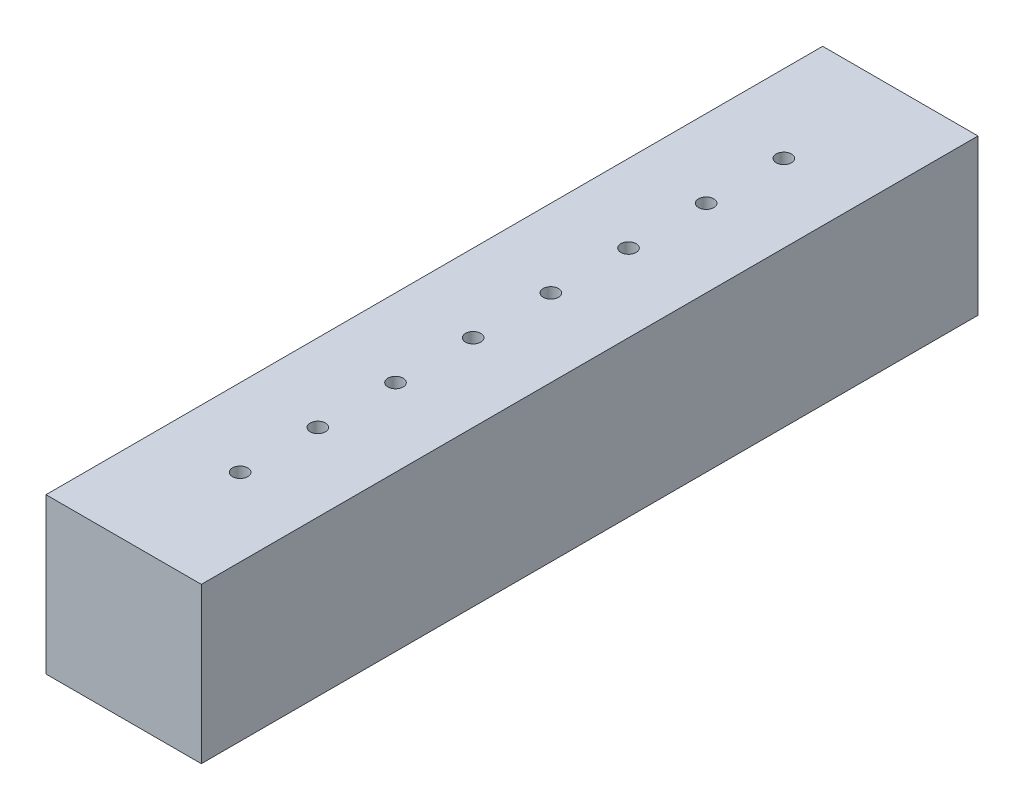
ISO-10303-21;
HEADER;
FILE_DESCRIPTION(('STEP AP214'),'2;1');
FILE_NAME('part.step','',(''),(''),'','','');
FILE_SCHEMA(('AUTOMOTIVE_DESIGN { 1 0 10303 214 1 1 1 1 }'));
ENDSEC;
DATA;
#1=APPLICATION_CONTEXT('core data for automotive mechanical design processes');
#2=APPLICATION_PROTOCOL_DEFINITION('international standard','automotive_design',2000,#1);
#3=PRODUCT_CONTEXT('',#1,'mechanical');
#4=PRODUCT('Part','Part','',(#3));
#5=PRODUCT_RELATED_PRODUCT_CATEGORY('part','',(#4));
#6=PRODUCT_DEFINITION_FORMATION('','',#4);
#7=PRODUCT_DEFINITION_CONTEXT('part definition',#1,'design');
#8=PRODUCT_DEFINITION('design','',#6,#7);
#9=PRODUCT_DEFINITION_SHAPE('','',#8);
#10=(LENGTH_UNIT() NAMED_UNIT(*) SI_UNIT(.MILLI.,.METRE.));
#11=(NAMED_UNIT(*) PLANE_ANGLE_UNIT() SI_UNIT($,.RADIAN.));
#12=(NAMED_UNIT(*) SI_UNIT($,.STERADIAN.) SOLID_ANGLE_UNIT());
#13=UNCERTAINTY_MEASURE_WITH_UNIT(LENGTH_MEASURE(1.E-05),#10,'distance_accuracy_value','');
#14=(GEOMETRIC_REPRESENTATION_CONTEXT(3) GLOBAL_UNCERTAINTY_ASSIGNED_CONTEXT((#13)) GLOBAL_UNIT_ASSIGNED_CONTEXT((#10,
#11,#12)) REPRESENTATION_CONTEXT('',''));
#15=CARTESIAN_POINT('',(0.,0.,0.));
#16=DIRECTION('',(0.,0.,1.));
#17=DIRECTION('',(1.,0.,0.));
#18=AXIS2_PLACEMENT_3D('',#15,#16,#17);
#19=CARTESIAN_POINT('',(-25.4,50.8,127.));
#20=DIRECTION('',(1.,0.,0.));
#21=DIRECTION('',(0.,0.,-1.));
#22=AXIS2_PLACEMENT_3D('',#19,#20,#21);
#23=PLANE('',#22);
#24=DIRECTION('',(0.,0.,1.));
#25=VECTOR('',#24,1.);
#26=CARTESIAN_POINT('',(-25.4,0.,127.));
#27=LINE('',#26,#25);
#28=CARTESIAN_POINT('',(-25.4,0.,-127.));
#29=VERTEX_POINT('',#28);
#30=CARTESIAN_POINT('',(-25.4,0.,127.));
#31=VERTEX_POINT('',#30);
#32=EDGE_CURVE('E96',#29,#31,#27,.T.);
#33=ORIENTED_EDGE('',*,*,#32,.T.);
#34=DIRECTION('',(0.,-1.,0.));
#35=VECTOR('',#34,1.);
#36=CARTESIAN_POINT('',(-25.4,50.8,127.));
#37=LINE('',#36,#35);
#38=CARTESIAN_POINT('',(-25.4,50.8,127.));
#39=VERTEX_POINT('',#38);
#40=EDGE_CURVE('E11',#39,#31,#37,.T.);
#41=ORIENTED_EDGE('',*,*,#40,.F.);
#42=DIRECTION('',(0.,0.,1.));
#43=VECTOR('',#42,1.);
#44=CARTESIAN_POINT('',(-25.4,50.8,127.));
#45=LINE('',#44,#43);
#46=CARTESIAN_POINT('',(-25.4,50.8,-127.));
#47=VERTEX_POINT('',#46);
#48=EDGE_CURVE('E84',#47,#39,#45,.T.);
#49=ORIENTED_EDGE('',*,*,#48,.F.);
#50=DIRECTION('',(0.,-1.,0.));
#51=VECTOR('',#50,1.);
#52=CARTESIAN_POINT('',(-25.4,50.8,-127.));
#53=LINE('',#52,#51);
#54=EDGE_CURVE('E92',#47,#29,#53,.T.);
#55=ORIENTED_EDGE('',*,*,#54,.T.);
#56=EDGE_LOOP('',(#33,#41,#49,#55));
#57=FACE_BOUND('',#56,.T.);
#58=ADVANCED_FACE('F33',(#57),#23,.F.);
#59=CARTESIAN_POINT('',(25.4,50.8,127.));
#60=DIRECTION('',(0.,0.,-1.));
#61=DIRECTION('',(-1.,0.,0.));
#62=AXIS2_PLACEMENT_3D('',#59,#60,#61);
#63=PLANE('',#62);
#64=DIRECTION('',(1.,0.,0.));
#65=VECTOR('',#64,1.);
#66=CARTESIAN_POINT('',(25.4,0.,127.));
#67=LINE('',#66,#65);
#68=CARTESIAN_POINT('',(25.4,0.,127.));
#69=VERTEX_POINT('',#68);
#70=EDGE_CURVE('E88',#31,#69,#67,.T.);
#71=ORIENTED_EDGE('',*,*,#70,.T.);
#72=DIRECTION('',(0.,-1.,0.));
#73=VECTOR('',#72,1.);
#74=CARTESIAN_POINT('',(25.4,50.8,127.));
#75=LINE('',#74,#73);
#76=CARTESIAN_POINT('',(25.4,50.8,127.));
#77=VERTEX_POINT('',#76);
#78=EDGE_CURVE('E41',#77,#69,#75,.T.);
#79=ORIENTED_EDGE('',*,*,#78,.F.);
#80=DIRECTION('',(1.,0.,0.));
#81=VECTOR('',#80,1.);
#82=CARTESIAN_POINT('',(25.4,50.8,127.));
#83=LINE('',#82,#81);
#84=EDGE_CURVE('E79',#39,#77,#83,.T.);
#85=ORIENTED_EDGE('',*,*,#84,.F.);
#86=ORIENTED_EDGE('',*,*,#40,.T.);
#87=EDGE_LOOP('',(#71,#79,#85,#86));
#88=FACE_BOUND('',#87,.T.);
#89=ADVANCED_FACE('F87',(#88),#63,.F.);
#90=CARTESIAN_POINT('',(25.4,50.8,127.));
#91=DIRECTION('',(-1.,0.,0.));
#92=DIRECTION('',(0.,0.,1.));
#93=AXIS2_PLACEMENT_3D('',#90,#91,#92);
#94=PLANE('',#93);
#95=DIRECTION('',(0.,0.,-1.));
#96=VECTOR('',#95,1.);
#97=CARTESIAN_POINT('',(25.4,0.,127.));
#98=LINE('',#97,#96);
#99=CARTESIAN_POINT('',(25.4,0.,-127.));
#100=VERTEX_POINT('',#99);
#101=EDGE_CURVE('E66',#69,#100,#98,.T.);
#102=ORIENTED_EDGE('',*,*,#101,.T.);
#103=DIRECTION('',(0.,-1.,0.));
#104=VECTOR('',#103,1.);
#105=CARTESIAN_POINT('',(25.4,50.8,-127.));
#106=LINE('',#105,#104);
#107=CARTESIAN_POINT('',(25.4,50.8,-127.));
#108=VERTEX_POINT('',#107);
#109=EDGE_CURVE('E89',#108,#100,#106,.T.);
#110=ORIENTED_EDGE('',*,*,#109,.F.);
#111=DIRECTION('',(0.,0.,-1.));
#112=VECTOR('',#111,1.);
#113=CARTESIAN_POINT('',(25.4,50.8,127.));
#114=LINE('',#113,#112);
#115=EDGE_CURVE('E82',#77,#108,#114,.T.);
#116=ORIENTED_EDGE('',*,*,#115,.F.);
#117=ORIENTED_EDGE('',*,*,#78,.T.);
#118=EDGE_LOOP('',(#102,#110,#116,#117));
#119=FACE_BOUND('',#118,.T.);
#120=ADVANCED_FACE('F90',(#119),#94,.F.);
#121=CARTESIAN_POINT('',(25.4,50.8,-127.));
#122=DIRECTION('',(0.,0.,1.));
#123=DIRECTION('',(1.,0.,0.));
#124=AXIS2_PLACEMENT_3D('',#121,#122,#123);
#125=PLANE('',#124);
#126=DIRECTION('',(-1.,0.,0.));
#127=VECTOR('',#126,1.);
#128=CARTESIAN_POINT('',(25.4,0.,-127.));
#129=LINE('',#128,#127);
#130=EDGE_CURVE('E72',#100,#29,#129,.T.);
#131=ORIENTED_EDGE('',*,*,#130,.T.);
#132=ORIENTED_EDGE('',*,*,#54,.F.);
#133=DIRECTION('',(-1.,0.,0.));
#134=VECTOR('',#133,1.);
#135=CARTESIAN_POINT('',(25.4,50.8,-127.));
#136=LINE('',#135,#134);
#137=EDGE_CURVE('E49',#108,#47,#136,.T.);
#138=ORIENTED_EDGE('',*,*,#137,.F.);
#139=ORIENTED_EDGE('',*,*,#109,.T.);
#140=EDGE_LOOP('',(#131,#132,#138,#139));
#141=FACE_BOUND('',#140,.T.);
#142=ADVANCED_FACE('F104',(#141),#125,.F.);
#143=CARTESIAN_POINT('',(0.,50.8,0.));
#144=DIRECTION('',(0.,1.,0.));
#145=DIRECTION('',(0.,0.,1.));
#146=AXIS2_PLACEMENT_3D('',#143,#144,#145);
#147=PLANE('',#146);
#148=CARTESIAN_POINT('',(0.,50.8,88.9));
#149=DIRECTION('',(0.,1.,0.));
#150=DIRECTION('',(0.,0.,1.));
#151=AXIS2_PLACEMENT_3D('',#148,#149,#150);
#152=CIRCLE('',#151,2.5019);
#153=CARTESIAN_POINT('',(0.,50.8,91.4019));
#154=VERTEX_POINT('',#153);
#155=EDGE_CURVE('E152',#154,#154,#152,.T.);
#156=ORIENTED_EDGE('',*,*,#155,.F.);
#157=EDGE_LOOP('',(#156));
#158=FACE_BOUND('',#157,.T.);
#159=CARTESIAN_POINT('',(0.,50.8,63.5));
#160=DIRECTION('',(0.,1.,0.));
#161=DIRECTION('',(0.,0.,1.));
#162=AXIS2_PLACEMENT_3D('',#159,#160,#161);
#163=CIRCLE('',#162,2.5019);
#164=CARTESIAN_POINT('',(0.,50.8,66.0019));
#165=VERTEX_POINT('',#164);
#166=EDGE_CURVE('E146',#165,#165,#163,.T.);
#167=ORIENTED_EDGE('',*,*,#166,.F.);
#168=EDGE_LOOP('',(#167));
#169=FACE_BOUND('',#168,.T.);
#170=CARTESIAN_POINT('',(0.,50.8,38.1));
#171=DIRECTION('',(0.,1.,0.));
#172=DIRECTION('',(0.,0.,1.));
#173=AXIS2_PLACEMENT_3D('',#170,#171,#172);
#174=CIRCLE('',#173,2.5019);
#175=CARTESIAN_POINT('',(0.,50.8,40.6019));
#176=VERTEX_POINT('',#175);
#177=EDGE_CURVE('E140',#176,#176,#174,.T.);
#178=ORIENTED_EDGE('',*,*,#177,.F.);
#179=EDGE_LOOP('',(#178));
#180=FACE_BOUND('',#179,.T.);
#181=CARTESIAN_POINT('',(0.,50.8,12.7));
#182=DIRECTION('',(0.,1.,0.));
#183=DIRECTION('',(0.,0.,1.));
#184=AXIS2_PLACEMENT_3D('',#181,#182,#183);
#185=CIRCLE('',#184,2.5019);
#186=CARTESIAN_POINT('',(0.,50.8,15.2019));
#187=VERTEX_POINT('',#186);
#188=EDGE_CURVE('E134',#187,#187,#185,.T.);
#189=ORIENTED_EDGE('',*,*,#188,.F.);
#190=EDGE_LOOP('',(#189));
#191=FACE_BOUND('',#190,.T.);
#192=CARTESIAN_POINT('',(0.,50.8,-12.7));
#193=DIRECTION('',(0.,1.,0.));
#194=DIRECTION('',(0.,0.,1.));
#195=AXIS2_PLACEMENT_3D('',#192,#193,#194);
#196=CIRCLE('',#195,2.5019);
#197=CARTESIAN_POINT('',(0.,50.8,-10.1981));
#198=VERTEX_POINT('',#197);
#199=EDGE_CURVE('E128',#198,#198,#196,.T.);
#200=ORIENTED_EDGE('',*,*,#199,.F.);
#201=EDGE_LOOP('',(#200));
#202=FACE_BOUND('',#201,.T.);
#203=CARTESIAN_POINT('',(0.,50.8,-38.1));
#204=DIRECTION('',(0.,1.,0.));
#205=DIRECTION('',(0.,0.,1.));
#206=AXIS2_PLACEMENT_3D('',#203,#204,#205);
#207=CIRCLE('',#206,2.5019);
#208=CARTESIAN_POINT('',(0.,50.8,-35.5981));
#209=VERTEX_POINT('',#208);
#210=EDGE_CURVE('E122',#209,#209,#207,.T.);
#211=ORIENTED_EDGE('',*,*,#210,.F.);
#212=EDGE_LOOP('',(#211));
#213=FACE_BOUND('',#212,.T.);
#214=CARTESIAN_POINT('',(0.,50.8,-63.5));
#215=DIRECTION('',(0.,1.,0.));
#216=DIRECTION('',(0.,0.,1.));
#217=AXIS2_PLACEMENT_3D('',#214,#215,#216);
#218=CIRCLE('',#217,2.5019);
#219=CARTESIAN_POINT('',(0.,50.8,-60.9981));
#220=VERTEX_POINT('',#219);
#221=EDGE_CURVE('E116',#220,#220,#218,.T.);
#222=ORIENTED_EDGE('',*,*,#221,.F.);
#223=EDGE_LOOP('',(#222));
#224=FACE_BOUND('',#223,.T.);
#225=CARTESIAN_POINT('',(0.,50.8,-88.9));
#226=DIRECTION('',(0.,1.,0.));
#227=DIRECTION('',(0.,0.,1.));
#228=AXIS2_PLACEMENT_3D('',#225,#226,#227);
#229=CIRCLE('',#228,2.5019);
#230=CARTESIAN_POINT('',(0.,50.8,-86.3981));
#231=VERTEX_POINT('',#230);
#232=EDGE_CURVE('E110',#231,#231,#229,.T.);
#233=ORIENTED_EDGE('',*,*,#232,.F.);
#234=EDGE_LOOP('',(#233));
#235=FACE_BOUND('',#234,.T.);
#236=ORIENTED_EDGE('',*,*,#48,.T.);
#237=ORIENTED_EDGE('',*,*,#84,.T.);
#238=ORIENTED_EDGE('',*,*,#115,.T.);
#239=ORIENTED_EDGE('',*,*,#137,.T.);
#240=EDGE_LOOP('',(#236,#237,#238,#239));
#241=FACE_BOUND('',#240,.T.);
#242=ADVANCED_FACE('F80',(#158,#169,#180,#191,#202,#213,#224,#235,#241),#147,.T.);
#243=CARTESIAN_POINT('',(0.,0.,0.));
#244=DIRECTION('',(0.,1.,0.));
#245=DIRECTION('',(0.,0.,1.));
#246=AXIS2_PLACEMENT_3D('',#243,#244,#245);
#247=PLANE('',#246);
#248=ORIENTED_EDGE('',*,*,#32,.F.);
#249=ORIENTED_EDGE('',*,*,#130,.F.);
#250=ORIENTED_EDGE('',*,*,#101,.F.);
#251=ORIENTED_EDGE('',*,*,#70,.F.);
#252=EDGE_LOOP('',(#248,#249,#250,#251));
#253=FACE_BOUND('',#252,.T.);
#254=ADVANCED_FACE('F107',(#253),#247,.F.);
#255=CARTESIAN_POINT('',(0.,41.91,-88.9));
#256=DIRECTION('',(0.,1.,0.));
#257=DIRECTION('',(0.,0.,1.));
#258=AXIS2_PLACEMENT_3D('',#255,#256,#257);
#259=CYLINDRICAL_SURFACE('',#258,2.5019);
#260=CARTESIAN_POINT('',(0.,41.91,-88.9));
#261=DIRECTION('',(0.,1.,0.));
#262=DIRECTION('',(0.,0.,1.));
#263=AXIS2_PLACEMENT_3D('',#260,#261,#262);
#264=CIRCLE('',#263,2.5019);
#265=CARTESIAN_POINT('',(0.,41.91,-86.3981));
#266=VERTEX_POINT('',#265);
#267=EDGE_CURVE('E99',#266,#266,#264,.T.);
#268=ORIENTED_EDGE('',*,*,#267,.F.);
#269=EDGE_LOOP('',(#268));
#270=FACE_BOUND('',#269,.T.);
#271=ORIENTED_EDGE('',*,*,#232,.T.);
#272=EDGE_LOOP('',(#271));
#273=FACE_BOUND('',#272,.T.);
#274=ADVANCED_FACE('F184',(#270,#273),#259,.F.);
#275=CARTESIAN_POINT('',(0.,41.91,-88.9));
#276=DIRECTION('',(0.,1.,0.));
#277=DIRECTION('',(0.,0.,1.));
#278=AXIS2_PLACEMENT_3D('',#275,#276,#277);
#279=PLANE('',#278);
#280=ORIENTED_EDGE('',*,*,#267,.T.);
#281=EDGE_LOOP('',(#280));
#282=FACE_BOUND('',#281,.T.);
#283=ADVANCED_FACE('F186',(#282),#279,.T.);
#284=CARTESIAN_POINT('',(0.,41.91,-63.5));
#285=DIRECTION('',(0.,1.,0.));
#286=DIRECTION('',(0.,0.,1.));
#287=AXIS2_PLACEMENT_3D('',#284,#285,#286);
#288=CYLINDRICAL_SURFACE('',#287,2.5019);
#289=CARTESIAN_POINT('',(0.,41.91,-63.5));
#290=DIRECTION('',(0.,1.,0.));
#291=DIRECTION('',(0.,0.,1.));
#292=AXIS2_PLACEMENT_3D('',#289,#290,#291);
#293=CIRCLE('',#292,2.5019);
#294=CARTESIAN_POINT('',(0.,41.91,-60.9981));
#295=VERTEX_POINT('',#294);
#296=EDGE_CURVE('E113',#295,#295,#293,.T.);
#297=ORIENTED_EDGE('',*,*,#296,.F.);
#298=EDGE_LOOP('',(#297));
#299=FACE_BOUND('',#298,.T.);
#300=ORIENTED_EDGE('',*,*,#221,.T.);
#301=EDGE_LOOP('',(#300));
#302=FACE_BOUND('',#301,.T.);
#303=ADVANCED_FACE('F193',(#299,#302),#288,.F.);
#304=CARTESIAN_POINT('',(0.,41.91,-63.5));
#305=DIRECTION('',(0.,1.,0.));
#306=DIRECTION('',(0.,0.,1.));
#307=AXIS2_PLACEMENT_3D('',#304,#305,#306);
#308=PLANE('',#307);
#309=ORIENTED_EDGE('',*,*,#296,.T.);
#310=EDGE_LOOP('',(#309));
#311=FACE_BOUND('',#310,.T.);
#312=ADVANCED_FACE('F241',(#311),#308,.T.);
#313=CARTESIAN_POINT('',(0.,41.91,-38.1));
#314=DIRECTION('',(0.,1.,0.));
#315=DIRECTION('',(0.,0.,1.));
#316=AXIS2_PLACEMENT_3D('',#313,#314,#315);
#317=CYLINDRICAL_SURFACE('',#316,2.5019);
#318=CARTESIAN_POINT('',(0.,41.91,-38.1));
#319=DIRECTION('',(0.,1.,0.));
#320=DIRECTION('',(0.,0.,1.));
#321=AXIS2_PLACEMENT_3D('',#318,#319,#320);
#322=CIRCLE('',#321,2.5019);
#323=CARTESIAN_POINT('',(0.,41.91,-35.5981));
#324=VERTEX_POINT('',#323);
#325=EDGE_CURVE('E119',#324,#324,#322,.T.);
#326=ORIENTED_EDGE('',*,*,#325,.F.);
#327=EDGE_LOOP('',(#326));
#328=FACE_BOUND('',#327,.T.);
#329=ORIENTED_EDGE('',*,*,#210,.T.);
#330=EDGE_LOOP('',(#329));
#331=FACE_BOUND('',#330,.T.);
#332=ADVANCED_FACE('F250',(#328,#331),#317,.F.);
#333=CARTESIAN_POINT('',(0.,41.91,-38.1));
#334=DIRECTION('',(0.,1.,0.));
#335=DIRECTION('',(0.,0.,1.));
#336=AXIS2_PLACEMENT_3D('',#333,#334,#335);
#337=PLANE('',#336);
#338=ORIENTED_EDGE('',*,*,#325,.T.);
#339=EDGE_LOOP('',(#338));
#340=FACE_BOUND('',#339,.T.);
#341=ADVANCED_FACE('F259',(#340),#337,.T.);
#342=CARTESIAN_POINT('',(0.,41.91,-12.7));
#343=DIRECTION('',(0.,1.,0.));
#344=DIRECTION('',(0.,0.,1.));
#345=AXIS2_PLACEMENT_3D('',#342,#343,#344);
#346=CYLINDRICAL_SURFACE('',#345,2.5019);
#347=CARTESIAN_POINT('',(0.,41.91,-12.7));
#348=DIRECTION('',(0.,1.,0.));
#349=DIRECTION('',(0.,0.,1.));
#350=AXIS2_PLACEMENT_3D('',#347,#348,#349);
#351=CIRCLE('',#350,2.5019);
#352=CARTESIAN_POINT('',(0.,41.91,-10.1981));
#353=VERTEX_POINT('',#352);
#354=EDGE_CURVE('E125',#353,#353,#351,.T.);
#355=ORIENTED_EDGE('',*,*,#354,.F.);
#356=EDGE_LOOP('',(#355));
#357=FACE_BOUND('',#356,.T.);
#358=ORIENTED_EDGE('',*,*,#199,.T.);
#359=EDGE_LOOP('',(#358));
#360=FACE_BOUND('',#359,.T.);
#361=ADVANCED_FACE('F268',(#357,#360),#346,.F.);
#362=CARTESIAN_POINT('',(0.,41.91,-12.7));
#363=DIRECTION('',(0.,1.,0.));
#364=DIRECTION('',(0.,0.,1.));
#365=AXIS2_PLACEMENT_3D('',#362,#363,#364);
#366=PLANE('',#365);
#367=ORIENTED_EDGE('',*,*,#354,.T.);
#368=EDGE_LOOP('',(#367));
#369=FACE_BOUND('',#368,.T.);
#370=ADVANCED_FACE('F277',(#369),#366,.T.);
#371=CARTESIAN_POINT('',(0.,41.91,12.7));
#372=DIRECTION('',(0.,1.,0.));
#373=DIRECTION('',(0.,0.,1.));
#374=AXIS2_PLACEMENT_3D('',#371,#372,#373);
#375=CYLINDRICAL_SURFACE('',#374,2.5019);
#376=CARTESIAN_POINT('',(0.,41.91,12.7));
#377=DIRECTION('',(0.,1.,0.));
#378=DIRECTION('',(0.,0.,1.));
#379=AXIS2_PLACEMENT_3D('',#376,#377,#378);
#380=CIRCLE('',#379,2.5019);
#381=CARTESIAN_POINT('',(0.,41.91,15.2019));
#382=VERTEX_POINT('',#381);
#383=EDGE_CURVE('E131',#382,#382,#380,.T.);
#384=ORIENTED_EDGE('',*,*,#383,.F.);
#385=EDGE_LOOP('',(#384));
#386=FACE_BOUND('',#385,.T.);
#387=ORIENTED_EDGE('',*,*,#188,.T.);
#388=EDGE_LOOP('',(#387));
#389=FACE_BOUND('',#388,.T.);
#390=ADVANCED_FACE('F286',(#386,#389),#375,.F.);
#391=CARTESIAN_POINT('',(0.,41.91,12.7));
#392=DIRECTION('',(0.,1.,0.));
#393=DIRECTION('',(0.,0.,1.));
#394=AXIS2_PLACEMENT_3D('',#391,#392,#393);
#395=PLANE('',#394);
#396=ORIENTED_EDGE('',*,*,#383,.T.);
#397=EDGE_LOOP('',(#396));
#398=FACE_BOUND('',#397,.T.);
#399=ADVANCED_FACE('F295',(#398),#395,.T.);
#400=CARTESIAN_POINT('',(0.,41.91,38.1));
#401=DIRECTION('',(0.,1.,0.));
#402=DIRECTION('',(0.,0.,1.));
#403=AXIS2_PLACEMENT_3D('',#400,#401,#402);
#404=CYLINDRICAL_SURFACE('',#403,2.5019);
#405=CARTESIAN_POINT('',(0.,41.91,38.1));
#406=DIRECTION('',(0.,1.,0.));
#407=DIRECTION('',(0.,0.,1.));
#408=AXIS2_PLACEMENT_3D('',#405,#406,#407);
#409=CIRCLE('',#408,2.5019);
#410=CARTESIAN_POINT('',(0.,41.91,40.6019));
#411=VERTEX_POINT('',#410);
#412=EDGE_CURVE('E137',#411,#411,#409,.T.);
#413=ORIENTED_EDGE('',*,*,#412,.F.);
#414=EDGE_LOOP('',(#413));
#415=FACE_BOUND('',#414,.T.);
#416=ORIENTED_EDGE('',*,*,#177,.T.);
#417=EDGE_LOOP('',(#416));
#418=FACE_BOUND('',#417,.T.);
#419=ADVANCED_FACE('F304',(#415,#418),#404,.F.);
#420=CARTESIAN_POINT('',(0.,41.91,38.1));
#421=DIRECTION('',(0.,1.,0.));
#422=DIRECTION('',(0.,0.,1.));
#423=AXIS2_PLACEMENT_3D('',#420,#421,#422);
#424=PLANE('',#423);
#425=ORIENTED_EDGE('',*,*,#412,.T.);
#426=EDGE_LOOP('',(#425));
#427=FACE_BOUND('',#426,.T.);
#428=ADVANCED_FACE('F313',(#427),#424,.T.);
#429=CARTESIAN_POINT('',(0.,41.91,63.5));
#430=DIRECTION('',(0.,1.,0.));
#431=DIRECTION('',(0.,0.,1.));
#432=AXIS2_PLACEMENT_3D('',#429,#430,#431);
#433=CYLINDRICAL_SURFACE('',#432,2.5019);
#434=CARTESIAN_POINT('',(0.,41.91,63.5));
#435=DIRECTION('',(0.,1.,0.));
#436=DIRECTION('',(0.,0.,1.));
#437=AXIS2_PLACEMENT_3D('',#434,#435,#436);
#438=CIRCLE('',#437,2.5019);
#439=CARTESIAN_POINT('',(0.,41.91,66.0019));
#440=VERTEX_POINT('',#439);
#441=EDGE_CURVE('E143',#440,#440,#438,.T.);
#442=ORIENTED_EDGE('',*,*,#441,.F.);
#443=EDGE_LOOP('',(#442));
#444=FACE_BOUND('',#443,.T.);
#445=ORIENTED_EDGE('',*,*,#166,.T.);
#446=EDGE_LOOP('',(#445));
#447=FACE_BOUND('',#446,.T.);
#448=ADVANCED_FACE('F322',(#444,#447),#433,.F.);
#449=CARTESIAN_POINT('',(0.,41.91,63.5));
#450=DIRECTION('',(0.,1.,0.));
#451=DIRECTION('',(0.,0.,1.));
#452=AXIS2_PLACEMENT_3D('',#449,#450,#451);
#453=PLANE('',#452);
#454=ORIENTED_EDGE('',*,*,#441,.T.);
#455=EDGE_LOOP('',(#454));
#456=FACE_BOUND('',#455,.T.);
#457=ADVANCED_FACE('F163',(#456),#453,.T.);
#458=CARTESIAN_POINT('',(0.,41.91,88.9));
#459=DIRECTION('',(0.,1.,0.));
#460=DIRECTION('',(0.,0.,1.));
#461=AXIS2_PLACEMENT_3D('',#458,#459,#460);
#462=CYLINDRICAL_SURFACE('',#461,2.5019);
#463=CARTESIAN_POINT('',(0.,41.91,88.9));
#464=DIRECTION('',(0.,1.,0.));
#465=DIRECTION('',(0.,0.,1.));
#466=AXIS2_PLACEMENT_3D('',#463,#464,#465);
#467=CIRCLE('',#466,2.5019);
#468=CARTESIAN_POINT('',(0.,41.91,91.4019));
#469=VERTEX_POINT('',#468);
#470=EDGE_CURVE('E149',#469,#469,#467,.T.);
#471=ORIENTED_EDGE('',*,*,#470,.F.);
#472=EDGE_LOOP('',(#471));
#473=FACE_BOUND('',#472,.T.);
#474=ORIENTED_EDGE('',*,*,#155,.T.);
#475=EDGE_LOOP('',(#474));
#476=FACE_BOUND('',#475,.T.);
#477=ADVANCED_FACE('F160',(#473,#476),#462,.F.);
#478=CARTESIAN_POINT('',(0.,41.91,88.9));
#479=DIRECTION('',(0.,1.,0.));
#480=DIRECTION('',(0.,0.,1.));
#481=AXIS2_PLACEMENT_3D('',#478,#479,#480);
#482=PLANE('',#481);
#483=ORIENTED_EDGE('',*,*,#470,.T.);
#484=EDGE_LOOP('',(#483));
#485=FACE_BOUND('',#484,.T.);
#486=ADVANCED_FACE('F158',(#485),#482,.T.);
#487=CLOSED_SHELL('',(#58,#89,#120,#142,#242,#254,#274,#283,#303,#312,#332,#341,#361,#370,#390,
#399,#419,#428,#448,#457,#477,#486));
#488=MANIFOLD_SOLID_BREP('B2',#487);
#489=ADVANCED_BREP_SHAPE_REPRESENTATION('',(#18,#488),#14);
#490=SHAPE_DEFINITION_REPRESENTATION(#9,#489);
ENDSEC;
END-ISO-10303-21;
